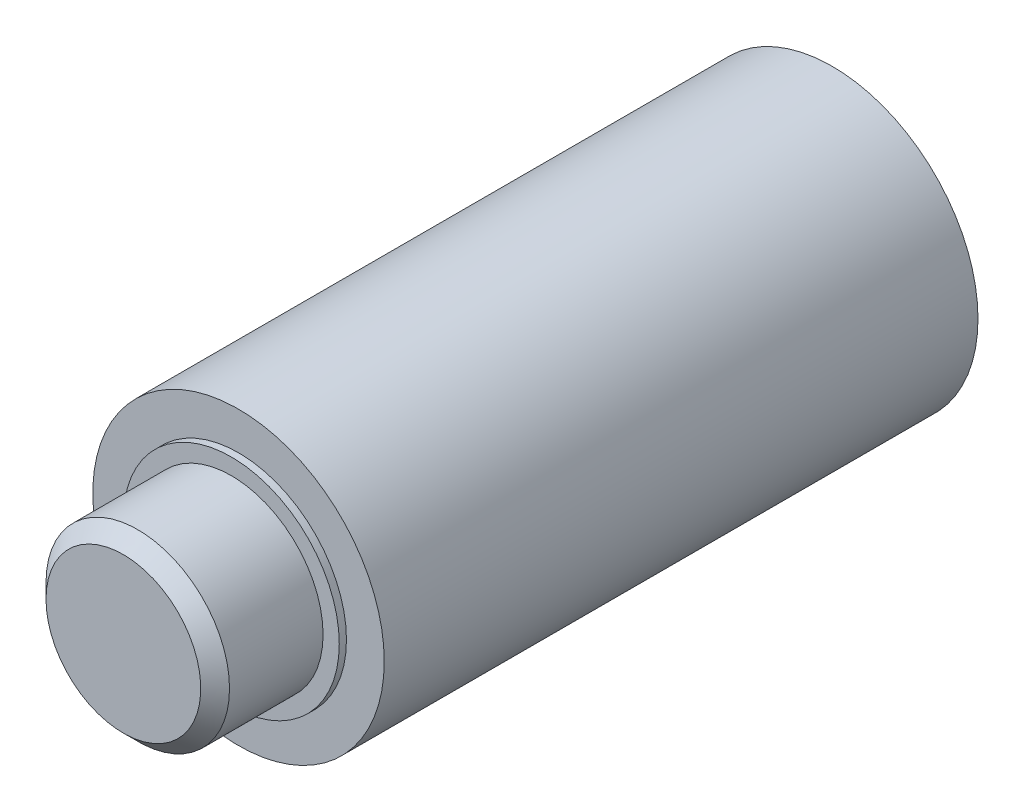
ISO-10303-21;
HEADER;
FILE_DESCRIPTION(('STEP AP214'),'2;1');
FILE_NAME('part.step','',(''),(''),'','','');
FILE_SCHEMA(('AUTOMOTIVE_DESIGN { 1 0 10303 214 1 1 1 1 }'));
ENDSEC;
DATA;
#1=APPLICATION_CONTEXT('core data for automotive mechanical design processes');
#2=APPLICATION_PROTOCOL_DEFINITION('international standard','automotive_design',2000,#1);
#3=PRODUCT_CONTEXT('',#1,'mechanical');
#4=PRODUCT('Part','Part','',(#3));
#5=PRODUCT_RELATED_PRODUCT_CATEGORY('part','',(#4));
#6=PRODUCT_DEFINITION_FORMATION('','',#4);
#7=PRODUCT_DEFINITION_CONTEXT('part definition',#1,'design');
#8=PRODUCT_DEFINITION('design','',#6,#7);
#9=PRODUCT_DEFINITION_SHAPE('','',#8);
#10=(LENGTH_UNIT() NAMED_UNIT(*) SI_UNIT(.MILLI.,.METRE.));
#11=(NAMED_UNIT(*) PLANE_ANGLE_UNIT() SI_UNIT($,.RADIAN.));
#12=(NAMED_UNIT(*) SI_UNIT($,.STERADIAN.) SOLID_ANGLE_UNIT());
#13=UNCERTAINTY_MEASURE_WITH_UNIT(LENGTH_MEASURE(1.E-05),#10,'distance_accuracy_value','');
#14=(GEOMETRIC_REPRESENTATION_CONTEXT(3) GLOBAL_UNCERTAINTY_ASSIGNED_CONTEXT((#13)) GLOBAL_UNIT_ASSIGNED_CONTEXT((#10,
#11,#12)) REPRESENTATION_CONTEXT('',''));
#15=CARTESIAN_POINT('',(0.,0.,0.));
#16=DIRECTION('',(0.,0.,1.));
#17=DIRECTION('',(1.,0.,0.));
#18=AXIS2_PLACEMENT_3D('',#15,#16,#17);
#19=CARTESIAN_POINT('',(-3.25,0.,6.8));
#20=DIRECTION('',(0.,0.,1.));
#21=DIRECTION('',(1.,0.,0.));
#22=AXIS2_PLACEMENT_3D('',#19,#20,#21);
#23=PLANE('',#22);
#24=CARTESIAN_POINT('',(0.,0.,6.8));
#25=DIRECTION('',(0.,0.,1.));
#26=DIRECTION('',(1.,0.,0.));
#27=AXIS2_PLACEMENT_3D('',#24,#25,#26);
#28=CIRCLE('',#27,3.25);
#29=CARTESIAN_POINT('',(0.575,-3.19873021682042,6.8));
#30=VERTEX_POINT('',#29);
#31=CARTESIAN_POINT('',(0.574999999999998,3.19873021682042,6.8));
#32=VERTEX_POINT('',#31);
#33=EDGE_CURVE('E156',#30,#32,#28,.T.);
#34=ORIENTED_EDGE('',*,*,#33,.F.);
#35=DIRECTION('',(0.,1.,0.));
#36=VECTOR('',#35,1.);
#37=CARTESIAN_POINT('',(0.574999999999999,0.,6.8));
#38=LINE('',#37,#36);
#39=EDGE_CURVE('E168',#30,#32,#38,.T.);
#40=ORIENTED_EDGE('',*,*,#39,.T.);
#41=EDGE_LOOP('',(#34,#40));
#42=FACE_BOUND('',#41,.T.);
#43=ADVANCED_FACE('F45',(#42),#23,.F.);
#44=CARTESIAN_POINT('',(0.,0.,19.7));
#45=DIRECTION('',(0.,0.,-1.));
#46=DIRECTION('',(-1.,0.,0.));
#47=AXIS2_PLACEMENT_3D('',#44,#45,#46);
#48=PLANE('',#47);
#49=CARTESIAN_POINT('',(0.,0.,19.7));
#50=DIRECTION('',(0.,0.,-1.));
#51=DIRECTION('',(-1.,0.,0.));
#52=AXIS2_PLACEMENT_3D('',#49,#50,#51);
#53=CIRCLE('',#52,2.15);
#54=CARTESIAN_POINT('',(-2.15,0.,19.7));
#55=VERTEX_POINT('',#54);
#56=EDGE_CURVE('E160',#55,#55,#53,.F.);
#57=ORIENTED_EDGE('',*,*,#56,.T.);
#58=EDGE_LOOP('',(#57));
#59=FACE_BOUND('',#58,.T.);
#60=ADVANCED_FACE('F197',(#59),#48,.F.);
#61=CARTESIAN_POINT('',(-0.574999999999999,3.19873021682042,6.8));
#62=VERTEX_POINT('',#61);
#63=CARTESIAN_POINT('',(-0.574999999999999,-3.19873021682042,6.8));
#64=VERTEX_POINT('',#63);
#65=EDGE_CURVE('E157',#62,#64,#28,.T.);
#66=ORIENTED_EDGE('',*,*,#65,.F.);
#67=DIRECTION('',(0.,-1.,0.));
#68=VECTOR('',#67,1.);
#69=CARTESIAN_POINT('',(-0.574999999999999,0.,6.8));
#70=LINE('',#69,#68);
#71=EDGE_CURVE('E55',#62,#64,#70,.T.);
#72=ORIENTED_EDGE('',*,*,#71,.T.);
#73=EDGE_LOOP('',(#66,#72));
#74=FACE_BOUND('',#73,.T.);
#75=ADVANCED_FACE('F188',(#74),#23,.F.);
#76=CARTESIAN_POINT('',(0.,0.,19.7));
#77=DIRECTION('',(0.,0.,1.));
#78=DIRECTION('',(1.,0.,0.));
#79=AXIS2_PLACEMENT_3D('',#76,#77,#78);
#80=CYLINDRICAL_SURFACE('',#79,3.25);
#81=ORIENTED_EDGE('',*,*,#33,.T.);
#82=CARTESIAN_POINT('',(0.,0.,-4.69999999999929));
#83=DIRECTION('',(-0.998752338877845,0.,0.0499376169438952));
#84=DIRECTION('',(0.0499376169438952,0.,0.998752338877845));
#85=AXIS2_PLACEMENT_3D('',#82,#83,#84);
#86=ELLIPSE('',#85,65.0811992821237,3.25);
#87=CARTESIAN_POINT('',(0.524999999999998,3.20731585597677,5.80000000000007));
#88=VERTEX_POINT('',#87);
#89=EDGE_CURVE('E180',#32,#88,#86,.T.);
#90=ORIENTED_EDGE('',*,*,#89,.T.);
#91=DIRECTION('',(0.,0.,1.));
#92=VECTOR('',#91,1.);
#93=CARTESIAN_POINT('',(0.524999999999998,3.20731585597677,5.3));
#94=LINE('',#93,#92);
#95=CARTESIAN_POINT('',(0.524999999999998,3.20731585597677,5.3));
#96=VERTEX_POINT('',#95);
#97=EDGE_CURVE('E127',#96,#88,#94,.T.);
#98=ORIENTED_EDGE('',*,*,#97,.F.);
#99=CARTESIAN_POINT('',(0.,0.,5.3));
#100=DIRECTION('',(0.,0.,1.));
#101=DIRECTION('',(-1.,0.,0.));
#102=AXIS2_PLACEMENT_3D('',#99,#100,#101);
#103=CIRCLE('',#102,3.25);
#104=CARTESIAN_POINT('',(-0.524999999999999,3.20731585597677,5.3));
#105=VERTEX_POINT('',#104);
#106=EDGE_CURVE('E117',#96,#105,#103,.T.);
#107=ORIENTED_EDGE('',*,*,#106,.T.);
#108=DIRECTION('',(0.,0.,1.));
#109=VECTOR('',#108,1.);
#110=CARTESIAN_POINT('',(-0.524999999999999,3.20731585597677,5.3));
#111=LINE('',#110,#109);
#112=CARTESIAN_POINT('',(-0.524999999999999,3.20731585597677,5.80000000000007));
#113=VERTEX_POINT('',#112);
#114=EDGE_CURVE('E114',#105,#113,#111,.T.);
#115=ORIENTED_EDGE('',*,*,#114,.T.);
#116=CARTESIAN_POINT('',(0.,0.,-4.6999999999992));
#117=DIRECTION('',(0.998752338877845,0.,0.0499376169438956));
#118=DIRECTION('',(-0.0499376169438956,0.,0.998752338877845));
#119=AXIS2_PLACEMENT_3D('',#116,#117,#118);
#120=ELLIPSE('',#119,65.0811992821232,3.25);
#121=EDGE_CURVE('E172',#113,#62,#120,.T.);
#122=ORIENTED_EDGE('',*,*,#121,.T.);
#123=ORIENTED_EDGE('',*,*,#65,.T.);
#124=CARTESIAN_POINT('',(0.,0.,-4.6999999999992));
#125=DIRECTION('',(0.998752338877845,0.,0.0499376169438956));
#126=DIRECTION('',(-0.0499376169438956,0.,0.998752338877845));
#127=AXIS2_PLACEMENT_3D('',#124,#125,#126);
#128=ELLIPSE('',#127,65.0811992821232,3.25);
#129=CARTESIAN_POINT('',(-0.524999999999998,-3.20731585597677,5.80000000000007));
#130=VERTEX_POINT('',#129);
#131=EDGE_CURVE('E62',#64,#130,#128,.T.);
#132=ORIENTED_EDGE('',*,*,#131,.T.);
#133=DIRECTION('',(0.,0.,1.));
#134=VECTOR('',#133,1.);
#135=CARTESIAN_POINT('',(-0.524999999999998,-3.20731585597677,5.3));
#136=LINE('',#135,#134);
#137=CARTESIAN_POINT('',(-0.524999999999998,-3.20731585597677,5.3));
#138=VERTEX_POINT('',#137);
#139=EDGE_CURVE('E112',#138,#130,#136,.T.);
#140=ORIENTED_EDGE('',*,*,#139,.F.);
#141=CARTESIAN_POINT('',(0.,0.,5.3));
#142=DIRECTION('',(0.,0.,1.));
#143=DIRECTION('',(-1.,0.,0.));
#144=AXIS2_PLACEMENT_3D('',#141,#142,#143);
#145=CIRCLE('',#144,3.25);
#146=CARTESIAN_POINT('',(0.525,-3.20731585597677,5.3));
#147=VERTEX_POINT('',#146);
#148=EDGE_CURVE('E100',#138,#147,#145,.T.);
#149=ORIENTED_EDGE('',*,*,#148,.T.);
#150=DIRECTION('',(0.,0.,1.));
#151=VECTOR('',#150,1.);
#152=CARTESIAN_POINT('',(0.525,-3.20731585597677,5.3));
#153=LINE('',#152,#151);
#154=CARTESIAN_POINT('',(0.525,-3.20731585597677,5.80000000000007));
#155=VERTEX_POINT('',#154);
#156=EDGE_CURVE('E123',#147,#155,#153,.T.);
#157=ORIENTED_EDGE('',*,*,#156,.T.);
#158=CARTESIAN_POINT('',(0.,0.,-4.69999999999929));
#159=DIRECTION('',(-0.998752338877845,0.,0.0499376169438952));
#160=DIRECTION('',(0.0499376169438952,0.,0.998752338877845));
#161=AXIS2_PLACEMENT_3D('',#158,#159,#160);
#162=ELLIPSE('',#161,65.0811992821237,3.25);
#163=EDGE_CURVE('E177',#155,#30,#162,.T.);
#164=ORIENTED_EDGE('',*,*,#163,.T.);
#165=EDGE_LOOP('',(#81,#90,#98,#107,#115,#122,#123,#132,#140,#149,#157,#164));
#166=FACE_BOUND('',#165,.T.);
#167=CARTESIAN_POINT('',(0.,0.,0.));
#168=DIRECTION('',(0.,0.,1.));
#169=DIRECTION('',(1.,0.,0.));
#170=AXIS2_PLACEMENT_3D('',#167,#168,#169);
#171=CIRCLE('',#170,3.25);
#172=CARTESIAN_POINT('',(3.25,0.,0.));
#173=VERTEX_POINT('',#172);
#174=EDGE_CURVE('E152',#173,#173,#171,.T.);
#175=ORIENTED_EDGE('',*,*,#174,.F.);
#176=EDGE_LOOP('',(#175));
#177=FACE_BOUND('',#176,.T.);
#178=ADVANCED_FACE('F120',(#166,#177),#80,.F.);
#179=CARTESIAN_POINT('',(-3.25,0.,0.));
#180=DIRECTION('',(0.,0.,1.));
#181=DIRECTION('',(1.,0.,0.));
#182=AXIS2_PLACEMENT_3D('',#179,#180,#181);
#183=PLANE('',#182);
#184=CARTESIAN_POINT('',(0.,0.,0.));
#185=DIRECTION('',(0.,0.,1.));
#186=DIRECTION('',(1.,0.,0.));
#187=AXIS2_PLACEMENT_3D('',#184,#185,#186);
#188=CIRCLE('',#187,4.05);
#189=CARTESIAN_POINT('',(4.05,0.,0.));
#190=VERTEX_POINT('',#189);
#191=EDGE_CURVE('E148',#190,#190,#188,.T.);
#192=ORIENTED_EDGE('',*,*,#191,.F.);
#193=EDGE_LOOP('',(#192));
#194=FACE_BOUND('',#193,.T.);
#195=ORIENTED_EDGE('',*,*,#174,.T.);
#196=EDGE_LOOP('',(#195));
#197=FACE_BOUND('',#196,.T.);
#198=ADVANCED_FACE('F211',(#194,#197),#183,.F.);
#199=CARTESIAN_POINT('',(0.,0.,19.7));
#200=DIRECTION('',(0.,0.,1.));
#201=DIRECTION('',(1.,0.,0.));
#202=AXIS2_PLACEMENT_3D('',#199,#200,#201);
#203=CYLINDRICAL_SURFACE('',#202,4.05);
#204=CARTESIAN_POINT('',(0.,0.,16.5));
#205=DIRECTION('',(0.,0.,1.));
#206=DIRECTION('',(1.,0.,0.));
#207=AXIS2_PLACEMENT_3D('',#204,#205,#206);
#208=CIRCLE('',#207,4.05);
#209=CARTESIAN_POINT('',(4.05,0.,16.5));
#210=VERTEX_POINT('',#209);
#211=EDGE_CURVE('E144',#210,#210,#208,.T.);
#212=ORIENTED_EDGE('',*,*,#211,.F.);
#213=EDGE_LOOP('',(#212));
#214=FACE_BOUND('',#213,.T.);
#215=ORIENTED_EDGE('',*,*,#191,.T.);
#216=EDGE_LOOP('',(#215));
#217=FACE_BOUND('',#216,.T.);
#218=ADVANCED_FACE('F215',(#214,#217),#203,.T.);
#219=CARTESIAN_POINT('',(-4.05,0.,16.5));
#220=DIRECTION('',(0.,0.,-1.));
#221=DIRECTION('',(-1.,0.,0.));
#222=AXIS2_PLACEMENT_3D('',#219,#220,#221);
#223=PLANE('',#222);
#224=CARTESIAN_POINT('',(0.,0.,16.5));
#225=DIRECTION('',(0.,0.,1.));
#226=DIRECTION('',(1.,0.,0.));
#227=AXIS2_PLACEMENT_3D('',#224,#225,#226);
#228=CIRCLE('',#227,3.);
#229=CARTESIAN_POINT('',(3.,0.,16.5));
#230=VERTEX_POINT('',#229);
#231=EDGE_CURVE('E140',#230,#230,#228,.T.);
#232=ORIENTED_EDGE('',*,*,#231,.F.);
#233=EDGE_LOOP('',(#232));
#234=FACE_BOUND('',#233,.T.);
#235=ORIENTED_EDGE('',*,*,#211,.T.);
#236=EDGE_LOOP('',(#235));
#237=FACE_BOUND('',#236,.T.);
#238=ADVANCED_FACE('F221',(#234,#237),#223,.F.);
#239=CARTESIAN_POINT('',(0.,0.,19.7));
#240=DIRECTION('',(0.,0.,1.));
#241=DIRECTION('',(1.,0.,0.));
#242=AXIS2_PLACEMENT_3D('',#239,#240,#241);
#243=CYLINDRICAL_SURFACE('',#242,3.);
#244=CARTESIAN_POINT('',(0.,0.,16.7));
#245=DIRECTION('',(0.,0.,1.));
#246=DIRECTION('',(1.,0.,0.));
#247=AXIS2_PLACEMENT_3D('',#244,#245,#246);
#248=CIRCLE('',#247,3.);
#249=CARTESIAN_POINT('',(3.,0.,16.7));
#250=VERTEX_POINT('',#249);
#251=EDGE_CURVE('E136',#250,#250,#248,.T.);
#252=ORIENTED_EDGE('',*,*,#251,.F.);
#253=EDGE_LOOP('',(#252));
#254=FACE_BOUND('',#253,.T.);
#255=ORIENTED_EDGE('',*,*,#231,.T.);
#256=EDGE_LOOP('',(#255));
#257=FACE_BOUND('',#256,.T.);
#258=ADVANCED_FACE('F225',(#254,#257),#243,.T.);
#259=CARTESIAN_POINT('',(-3.,0.,16.7));
#260=DIRECTION('',(0.,0.,-1.));
#261=DIRECTION('',(-1.,0.,0.));
#262=AXIS2_PLACEMENT_3D('',#259,#260,#261);
#263=PLANE('',#262);
#264=CARTESIAN_POINT('',(0.,0.,16.7));
#265=DIRECTION('',(0.,0.,1.));
#266=DIRECTION('',(1.,0.,0.));
#267=AXIS2_PLACEMENT_3D('',#264,#265,#266);
#268=CIRCLE('',#267,2.55);
#269=CARTESIAN_POINT('',(2.55,0.,16.7));
#270=VERTEX_POINT('',#269);
#271=EDGE_CURVE('E132',#270,#270,#268,.T.);
#272=ORIENTED_EDGE('',*,*,#271,.F.);
#273=EDGE_LOOP('',(#272));
#274=FACE_BOUND('',#273,.T.);
#275=ORIENTED_EDGE('',*,*,#251,.T.);
#276=EDGE_LOOP('',(#275));
#277=FACE_BOUND('',#276,.T.);
#278=ADVANCED_FACE('F229',(#274,#277),#263,.F.);
#279=CARTESIAN_POINT('',(0.,0.,19.7));
#280=DIRECTION('',(0.,0.,1.));
#281=DIRECTION('',(1.,0.,0.));
#282=AXIS2_PLACEMENT_3D('',#279,#280,#281);
#283=CYLINDRICAL_SURFACE('',#282,2.55);
#284=CARTESIAN_POINT('',(0.,0.,19.3));
#285=DIRECTION('',(0.,0.,-1.));
#286=DIRECTION('',(-1.,0.,0.));
#287=AXIS2_PLACEMENT_3D('',#284,#285,#286);
#288=CIRCLE('',#287,2.55);
#289=CARTESIAN_POINT('',(-2.55,0.,19.3));
#290=VERTEX_POINT('',#289);
#291=EDGE_CURVE('E164',#290,#290,#288,.T.);
#292=ORIENTED_EDGE('',*,*,#291,.T.);
#293=EDGE_LOOP('',(#292));
#294=FACE_BOUND('',#293,.T.);
#295=ORIENTED_EDGE('',*,*,#271,.T.);
#296=EDGE_LOOP('',(#295));
#297=FACE_BOUND('',#296,.T.);
#298=ADVANCED_FACE('F233',(#294,#297),#283,.T.);
#299=CARTESIAN_POINT('',(0.,0.,19.7));
#300=DIRECTION('',(0.,0.,-1.));
#301=DIRECTION('',(-1.,0.,0.));
#302=AXIS2_PLACEMENT_3D('',#299,#300,#301);
#303=CONICAL_SURFACE('',#302,2.15,0.785398163397447);
#304=ORIENTED_EDGE('',*,*,#291,.F.);
#305=EDGE_LOOP('',(#304));
#306=FACE_BOUND('',#305,.T.);
#307=ORIENTED_EDGE('',*,*,#56,.F.);
#308=EDGE_LOOP('',(#307));
#309=FACE_BOUND('',#308,.T.);
#310=ADVANCED_FACE('F237',(#306,#309),#303,.T.);
#311=CARTESIAN_POINT('',(0.524999999999998,3.20731585597677,5.3));
#312=DIRECTION('',(1.,0.,0.));
#313=DIRECTION('',(0.,1.,0.));
#314=AXIS2_PLACEMENT_3D('',#311,#312,#313);
#315=PLANE('',#314);
#316=ORIENTED_EDGE('',*,*,#97,.T.);
#317=DIRECTION('',(0.,-1.,0.));
#318=VECTOR('',#317,1.);
#319=CARTESIAN_POINT('',(0.524999999999998,3.20731585597677,5.80000000000007));
#320=LINE('',#319,#318);
#321=EDGE_CURVE('E183',#88,#155,#320,.T.);
#322=ORIENTED_EDGE('',*,*,#321,.T.);
#323=ORIENTED_EDGE('',*,*,#156,.F.);
#324=DIRECTION('',(0.,1.,0.));
#325=VECTOR('',#324,1.);
#326=CARTESIAN_POINT('',(0.524999999999998,3.20731585597677,5.3));
#327=LINE('',#326,#325);
#328=EDGE_CURVE('E106',#147,#96,#327,.T.);
#329=ORIENTED_EDGE('',*,*,#328,.T.);
#330=EDGE_LOOP('',(#316,#322,#323,#329));
#331=FACE_BOUND('',#330,.T.);
#332=ADVANCED_FACE('F241',(#331),#315,.T.);
#333=CARTESIAN_POINT('',(-0.524999999999999,-3.20731585597677,5.3));
#334=DIRECTION('',(-1.,0.,0.));
#335=DIRECTION('',(0.,0.,1.));
#336=AXIS2_PLACEMENT_3D('',#333,#334,#335);
#337=PLANE('',#336);
#338=ORIENTED_EDGE('',*,*,#139,.T.);
#339=DIRECTION('',(0.,1.,0.));
#340=VECTOR('',#339,1.);
#341=CARTESIAN_POINT('',(-0.524999999999999,-3.20731585597677,5.80000000000007));
#342=LINE('',#341,#340);
#343=EDGE_CURVE('E11',#130,#113,#342,.T.);
#344=ORIENTED_EDGE('',*,*,#343,.T.);
#345=ORIENTED_EDGE('',*,*,#114,.F.);
#346=DIRECTION('',(0.,-1.,0.));
#347=VECTOR('',#346,1.);
#348=CARTESIAN_POINT('',(-0.524999999999999,-3.20731585597677,5.3));
#349=LINE('',#348,#347);
#350=EDGE_CURVE('E103',#105,#138,#349,.T.);
#351=ORIENTED_EDGE('',*,*,#350,.T.);
#352=EDGE_LOOP('',(#338,#344,#345,#351));
#353=FACE_BOUND('',#352,.T.);
#354=ADVANCED_FACE('F111',(#353),#337,.T.);
#355=CARTESIAN_POINT('',(0.,0.,5.3));
#356=DIRECTION('',(0.,0.,-1.));
#357=DIRECTION('',(-1.,0.,0.));
#358=AXIS2_PLACEMENT_3D('',#355,#356,#357);
#359=PLANE('',#358);
#360=ORIENTED_EDGE('',*,*,#106,.F.);
#361=ORIENTED_EDGE('',*,*,#328,.F.);
#362=ORIENTED_EDGE('',*,*,#148,.F.);
#363=ORIENTED_EDGE('',*,*,#350,.F.);
#364=EDGE_LOOP('',(#360,#361,#362,#363));
#365=FACE_BOUND('',#364,.T.);
#366=ADVANCED_FACE('F102',(#365),#359,.T.);
#367=CARTESIAN_POINT('',(0.574999999999999,0.,6.8));
#368=DIRECTION('',(-0.998752338877845,0.,0.0499376169438952));
#369=DIRECTION('',(0.,1.,0.));
#370=AXIS2_PLACEMENT_3D('',#367,#368,#369);
#371=PLANE('',#370);
#372=ORIENTED_EDGE('',*,*,#163,.F.);
#373=ORIENTED_EDGE('',*,*,#321,.F.);
#374=ORIENTED_EDGE('',*,*,#89,.F.);
#375=ORIENTED_EDGE('',*,*,#39,.F.);
#376=EDGE_LOOP('',(#372,#373,#374,#375));
#377=FACE_BOUND('',#376,.T.);
#378=ADVANCED_FACE('F191',(#377),#371,.F.);
#379=CARTESIAN_POINT('',(-0.574999999999999,0.,6.8));
#380=DIRECTION('',(0.998752338877845,0.,0.0499376169438956));
#381=DIRECTION('',(0.,-1.,0.));
#382=AXIS2_PLACEMENT_3D('',#379,#380,#381);
#383=PLANE('',#382);
#384=ORIENTED_EDGE('',*,*,#121,.F.);
#385=ORIENTED_EDGE('',*,*,#343,.F.);
#386=ORIENTED_EDGE('',*,*,#131,.F.);
#387=ORIENTED_EDGE('',*,*,#71,.F.);
#388=EDGE_LOOP('',(#384,#385,#386,#387));
#389=FACE_BOUND('',#388,.T.);
#390=ADVANCED_FACE('F48',(#389),#383,.F.);
#391=CLOSED_SHELL('',(#43,#60,#75,#178,#198,#218,#238,#258,#278,#298,#310,#332,#354,#366,#378,#390));
#392=MANIFOLD_SOLID_BREP('B2',#391);
#393=ADVANCED_BREP_SHAPE_REPRESENTATION('',(#18,#392),#14);
#394=SHAPE_DEFINITION_REPRESENTATION(#9,#393);
ENDSEC;
END-ISO-10303-21;
